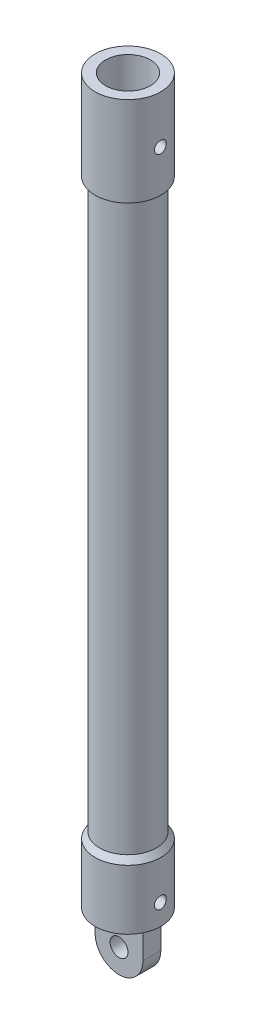
ISO-10303-21;
HEADER;
FILE_DESCRIPTION(('STEP AP214'),'2;1');
FILE_NAME('part.step','',(''),(''),'','','');
FILE_SCHEMA(('AUTOMOTIVE_DESIGN { 1 0 10303 214 1 1 1 1 }'));
ENDSEC;
DATA;
#1=APPLICATION_CONTEXT('core data for automotive mechanical design processes');
#2=APPLICATION_PROTOCOL_DEFINITION('international standard','automotive_design',2000,#1);
#3=PRODUCT_CONTEXT('',#1,'mechanical');
#4=PRODUCT('Part','Part','',(#3));
#5=PRODUCT_RELATED_PRODUCT_CATEGORY('part','',(#4));
#6=PRODUCT_DEFINITION_FORMATION('','',#4);
#7=PRODUCT_DEFINITION_CONTEXT('part definition',#1,'design');
#8=PRODUCT_DEFINITION('design','',#6,#7);
#9=PRODUCT_DEFINITION_SHAPE('','',#8);
#10=(LENGTH_UNIT() NAMED_UNIT(*) SI_UNIT(.MILLI.,.METRE.));
#11=(NAMED_UNIT(*) PLANE_ANGLE_UNIT() SI_UNIT($,.RADIAN.));
#12=(NAMED_UNIT(*) SI_UNIT($,.STERADIAN.) SOLID_ANGLE_UNIT());
#13=UNCERTAINTY_MEASURE_WITH_UNIT(LENGTH_MEASURE(1.E-05),#10,'distance_accuracy_value','');
#14=(GEOMETRIC_REPRESENTATION_CONTEXT(3) GLOBAL_UNCERTAINTY_ASSIGNED_CONTEXT((#13)) GLOBAL_UNIT_ASSIGNED_CONTEXT((#10,
#11,#12)) REPRESENTATION_CONTEXT('',''));
#15=CARTESIAN_POINT('',(0.,0.,0.));
#16=DIRECTION('',(0.,0.,1.));
#17=DIRECTION('',(1.,0.,0.));
#18=AXIS2_PLACEMENT_3D('',#15,#16,#17);
#19=CARTESIAN_POINT('',(0.,121.,0.));
#20=DIRECTION('',(0.,1.,0.));
#21=DIRECTION('',(-1.,0.,0.));
#22=AXIS2_PLACEMENT_3D('',#19,#20,#21);
#23=CYLINDRICAL_SURFACE('',#22,5.49999999999999);
#24=CARTESIAN_POINT('',(0.,9.99999999999999,0.));
#25=DIRECTION('',(0.,1.,0.));
#26=DIRECTION('',(-1.,0.,0.));
#27=AXIS2_PLACEMENT_3D('',#24,#25,#26);
#28=CIRCLE('',#27,5.49999999999998);
#29=CARTESIAN_POINT('',(-5.49999999999998,9.99999999999999,0.));
#30=VERTEX_POINT('',#29);
#31=EDGE_CURVE('E53',#30,#30,#28,.T.);
#32=ORIENTED_EDGE('',*,*,#31,.F.);
#33=EDGE_LOOP('',(#32));
#34=FACE_BOUND('',#33,.T.);
#35=CARTESIAN_POINT('',(0.,0.,0.));
#36=DIRECTION('',(0.,1.,0.));
#37=DIRECTION('',(-1.,0.,0.));
#38=AXIS2_PLACEMENT_3D('',#35,#36,#37);
#39=CIRCLE('',#38,5.5);
#40=CARTESIAN_POINT('',(-5.5,0.,0.));
#41=VERTEX_POINT('',#40);
#42=EDGE_CURVE('E11',#41,#41,#39,.T.);
#43=ORIENTED_EDGE('',*,*,#42,.T.);
#44=EDGE_LOOP('',(#43));
#45=FACE_BOUND('',#44,.T.);
#46=CARTESIAN_POINT('',(5.40832691319598,3.5,0.999999999999986));
#47=CARTESIAN_POINT('',(5.40832797364527,3.55567006127892,0.999997833744751));
#48=CARTESIAN_POINT('',(5.4091957939202,3.61136859562177,0.99533550211966));
#49=CARTESIAN_POINT('',(5.41256931618595,3.72119730791599,0.976820659835397));
#50=CARTESIAN_POINT('',(5.41507644189577,3.77532607983057,0.962960160510861));
#51=CARTESIAN_POINT('',(5.42143545133149,3.88041015651649,0.926486846446951));
#52=CARTESIAN_POINT('',(5.42528611875606,3.93136828265597,0.903881945963418));
#53=CARTESIAN_POINT('',(5.43389689920319,4.02876494581255,0.850582127041999));
#54=CARTESIAN_POINT('',(5.438656932397,4.07520387900767,0.819887918635005));
#55=CARTESIAN_POINT('',(5.44861236895209,4.16279172372141,0.750897624119697));
#56=CARTESIAN_POINT('',(5.45381181531896,4.20388003711712,0.712525176739006));
#57=CARTESIAN_POINT('',(5.46402446588598,4.27907278141708,0.629432698170825));
#58=CARTESIAN_POINT('',(5.46903765818915,4.31317676682265,0.584712262381744));
#59=CARTESIAN_POINT('',(5.47835611996115,4.37366365922516,0.489796709499911));
#60=CARTESIAN_POINT('',(5.48265607320121,4.39998963499791,0.439564745239927));
#61=CARTESIAN_POINT('',(5.49001838668284,4.44380666651306,0.335299887218793));
#62=CARTESIAN_POINT('',(5.49308084259508,4.46129840525468,0.281267287663326));
#63=CARTESIAN_POINT('',(5.49759455294157,4.48676361662773,0.171562418910415));
#64=CARTESIAN_POINT('',(5.4990630727262,4.49483915716037,0.11591456425937));
#65=CARTESIAN_POINT('',(5.50028290444733,4.5015605837312,0.00403573648294886));
#66=CARTESIAN_POINT('',(5.50003435424196,4.50020722678577,-0.0521951894675326));
#67=CARTESIAN_POINT('',(5.49786159276055,4.48818792896104,-0.162944598070384));
#68=CARTESIAN_POINT('',(5.49595715438453,4.47763187324278,-0.217475450026688));
#69=CARTESIAN_POINT('',(5.49070873453987,4.44768040126925,-0.323978745301697));
#70=CARTESIAN_POINT('',(5.4873647029595,4.42828467730689,-0.375951099489815));
#71=CARTESIAN_POINT('',(5.47957960186177,4.38109847011042,-0.476183112726937));
#72=CARTESIAN_POINT('',(5.4751327651169,4.35326367798308,-0.524421446258747));
#73=CARTESIAN_POINT('',(5.4656344841086,4.29002205503766,-0.615583816786477));
#74=CARTESIAN_POINT('',(5.46058298192138,4.25461449853226,-0.658507343849124));
#75=CARTESIAN_POINT('',(5.45034954046419,4.17662577271036,-0.738472225271986));
#76=CARTESIAN_POINT('',(5.44516677076056,4.13394849104051,-0.77541979702476));
#77=CARTESIAN_POINT('',(5.43532481034289,4.04295296803955,-0.841646359820844));
#78=CARTESIAN_POINT('',(5.43066562641451,3.99463465361737,-0.87092525148485));
#79=CARTESIAN_POINT('',(5.42239736704915,3.89360874475659,-0.921007691245477));
#80=CARTESIAN_POINT('',(5.41878990006367,3.84089458418011,-0.941798276926126));
#81=CARTESIAN_POINT('',(5.41305866738467,3.73264127505582,-0.974201884435004));
#82=CARTESIAN_POINT('',(5.41093474435717,3.67710242674443,-0.985815879483392));
#83=CARTESIAN_POINT('',(5.40844202046371,3.5656200993973,-0.999401089257744));
#84=CARTESIAN_POINT('',(5.40804875191387,3.50969353366519,-1.00150674244584));
#85=CARTESIAN_POINT('',(5.40899647576944,3.39828772471947,-0.996375273894262));
#86=CARTESIAN_POINT('',(5.41033738779431,3.34280846089302,-0.989138585178957));
#87=CARTESIAN_POINT('',(5.41457964689336,3.23430982797386,-0.9656430481945));
#88=CARTESIAN_POINT('',(5.41746890003941,3.18127480799599,-0.949454094276894));
#89=CARTESIAN_POINT('',(5.42447195400377,3.07867014058578,-0.908587487859402));
#90=CARTESIAN_POINT('',(5.42858584033863,3.02910073545717,-0.883909242530555));
#91=CARTESIAN_POINT('',(5.43763067076331,2.93424040199238,-0.826452930939983));
#92=CARTESIAN_POINT('',(5.44257002421487,2.88900194095781,-0.793589589707847));
#93=CARTESIAN_POINT('',(5.45268533146009,2.80463315420113,-0.720811524753696));
#94=CARTESIAN_POINT('',(5.457861305175,2.76550334400018,-0.680896206506637));
#95=CARTESIAN_POINT('',(5.46794493022656,2.69396357692511,-0.594548150036321));
#96=CARTESIAN_POINT('',(5.47284841413377,2.6616438223191,-0.548040116261898));
#97=CARTESIAN_POINT('',(5.48176540688882,2.60527684695851,-0.450176309896779));
#98=CARTESIAN_POINT('',(5.48577894853026,2.58122932136142,-0.398820716033939));
#99=CARTESIAN_POINT('',(5.49244586315786,2.54222598068178,-0.292974109172686));
#100=CARTESIAN_POINT('',(5.49510597552398,2.52722504756174,-0.23850016467699));
#101=CARTESIAN_POINT('',(5.49879498739044,2.50659632835142,-0.127753324481755));
#102=CARTESIAN_POINT('',(5.49982404783878,2.50096761743165,-0.0714806068396321));
#103=CARTESIAN_POINT('',(5.50013207106944,2.49927373944725,0.0403998095143955));
#104=CARTESIAN_POINT('',(5.4994360161558,2.50307205575767,0.0960054189627159));
#105=CARTESIAN_POINT('',(5.49642366951048,2.51982647321196,0.205772269495412));
#106=CARTESIAN_POINT('',(5.49410739135889,2.53278249759946,0.259933522681873));
#107=CARTESIAN_POINT('',(5.4881145345394,2.56742845174468,0.365207716720227));
#108=CARTESIAN_POINT('',(5.48444009174283,2.58910467268796,0.416325298323182));
#109=CARTESIAN_POINT('',(5.47612961195726,2.6405597014042,0.514218505970973));
#110=CARTESIAN_POINT('',(5.47149351575704,2.67033900813803,0.560993864398296));
#111=CARTESIAN_POINT('',(5.46169295104725,2.73762881928164,0.649557298768095));
#112=CARTESIAN_POINT('',(5.4565221897774,2.77523834769477,0.691269449293605));
#113=CARTESIAN_POINT('',(5.44627585142042,2.85691475834417,0.767838111774039));
#114=CARTESIAN_POINT('',(5.44120029696122,2.90098315427109,0.80269301217654));
#115=CARTESIAN_POINT('',(5.4316714143499,2.99477983780895,0.864838359022284));
#116=CARTESIAN_POINT('',(5.42722382409738,3.04455361968942,0.892061042527079));
#117=CARTESIAN_POINT('',(5.4195230878375,3.14803163839711,0.937715294552622));
#118=CARTESIAN_POINT('',(5.41626879622785,3.20173204581306,0.956155299818046));
#119=CARTESIAN_POINT('',(5.41201405367095,3.29633834221095,0.979899481024931));
#120=CARTESIAN_POINT('',(5.41063943605989,3.33668463130228,0.987424495948263));
#121=CARTESIAN_POINT('',(5.40879548637076,3.41801547601812,0.997475492125657));
#122=CARTESIAN_POINT('',(5.40832613219443,3.45900001603777,1.00000159540742));
#123=CARTESIAN_POINT('',(5.40832691319598,3.5,0.999999999999986));
#124=B_SPLINE_CURVE_WITH_KNOTS('',3,(#46,#47,#48,#49,#50,#51,#52,#53,#54,#55,#56,#57,#58,#59,
#60,#61,#62,#63,#64,#65,#66,#67,#68,#69,#70,#71,#72,#73,#74,#75,#76,#77,#78,#79,#80,#81,#82,#83,
#84,#85,#86,#87,#88,#89,#90,#91,#92,#93,#94,#95,#96,#97,#98,#99,#100,#101,#102,#103,#104,#105,
#106,#107,#108,#109,#110,#111,#112,#113,#114,#115,#116,#117,#118,#119,#120,#121,#122,#123),
.UNSPECIFIED.,.T.,.F.,(4,2,2,2,2,2,2,2,2,2,2,2,2,2,2,2,2,2,2,2,2,2,2,2,2,2,2,2,2,2,2,2,2,2,2,2,
2,2,4),(0.,0.166860176303694,0.333865461691933,0.500719948670007,0.667559795037679,
0.836149675555551,1.00475030631164,1.17455606253914,1.34434868860495,1.51228319705907,
1.6802042227379,1.84614722644409,2.01209600703444,2.17893164241915,2.34578327259646,
2.51504175421998,2.68430242917503,2.85382062241291,3.02332083504319,3.19041682321415,
3.35750506664222,3.52330682829013,3.68912017065095,3.85673910114988,4.02437216970491,
4.19410261282722,4.36382680048964,4.53269736835609,4.70155127147238,4.86797423941391,
5.03439581247915,5.20055677418129,5.36672796983505,5.53514439851506,5.70360036032117,
5.87350774145283,6.04325157670206,6.16614405072609,6.28903352480283),.UNSPECIFIED.);
#125=CARTESIAN_POINT('',(5.40832691319598,3.5,0.999999999999986));
#126=VERTEX_POINT('',#125);
#127=EDGE_CURVE('E117',#126,#126,#124,.T.);
#128=ORIENTED_EDGE('',*,*,#127,.T.);
#129=EDGE_LOOP('',(#128));
#130=FACE_BOUND('',#129,.T.);
#131=ADVANCED_FACE('F38',(#34,#45,#130),#23,.T.);
#132=CARTESIAN_POINT('',(0.,121.,0.));
#133=DIRECTION('',(0.,1.,0.));
#134=DIRECTION('',(-1.,0.,0.));
#135=AXIS2_PLACEMENT_3D('',#132,#133,#134);
#136=CYLINDRICAL_SURFACE('',#135,5.5);
#137=CARTESIAN_POINT('',(0.,121.,0.));
#138=DIRECTION('',(0.,1.,0.));
#139=DIRECTION('',(-1.,0.,0.));
#140=AXIS2_PLACEMENT_3D('',#137,#138,#139);
#141=CIRCLE('',#140,5.5);
#142=CARTESIAN_POINT('',(-5.5,121.,0.));
#143=VERTEX_POINT('',#142);
#144=EDGE_CURVE('E155',#143,#143,#141,.T.);
#145=ORIENTED_EDGE('',*,*,#144,.F.);
#146=EDGE_LOOP('',(#145));
#147=FACE_BOUND('',#146,.T.);
#148=CARTESIAN_POINT('',(0.,106.,0.));
#149=DIRECTION('',(0.,1.,0.));
#150=DIRECTION('',(-1.,0.,0.));
#151=AXIS2_PLACEMENT_3D('',#148,#149,#150);
#152=CIRCLE('',#151,5.5);
#153=CARTESIAN_POINT('',(-5.5,106.,0.));
#154=VERTEX_POINT('',#153);
#155=EDGE_CURVE('E159',#154,#154,#152,.T.);
#156=ORIENTED_EDGE('',*,*,#155,.T.);
#157=EDGE_LOOP('',(#156));
#158=FACE_BOUND('',#157,.T.);
#159=CARTESIAN_POINT('',(5.40832691319599,113.,0.999999999999999));
#160=CARTESIAN_POINT('',(5.40832797364529,113.055670061279,0.999997833744765));
#161=CARTESIAN_POINT('',(5.40919579392022,113.111368595622,0.995335502119673));
#162=CARTESIAN_POINT('',(5.41256931618597,113.221197307916,0.97682065983541));
#163=CARTESIAN_POINT('',(5.41507644189579,113.275326079831,0.962960160510874));
#164=CARTESIAN_POINT('',(5.42143545133151,113.380410156516,0.926486846446966));
#165=CARTESIAN_POINT('',(5.42528611875607,113.431368282656,0.903881945963434));
#166=CARTESIAN_POINT('',(5.4338968992032,113.528764945813,0.850582127042015));
#167=CARTESIAN_POINT('',(5.43865693239701,113.575203879008,0.819887918635019));
#168=CARTESIAN_POINT('',(5.44861236895211,113.662791723721,0.750897624119713));
#169=CARTESIAN_POINT('',(5.45381181531897,113.703880037117,0.712525176739026));
#170=CARTESIAN_POINT('',(5.464024465886,113.779072781417,0.629432698170844));
#171=CARTESIAN_POINT('',(5.46903765818916,113.813176766823,0.584712262381758));
#172=CARTESIAN_POINT('',(5.47835611996117,113.873663659225,0.489796709499921));
#173=CARTESIAN_POINT('',(5.48265607320123,113.899989634998,0.439564745239938));
#174=CARTESIAN_POINT('',(5.49001838668286,113.943806666513,0.335299887218804));
#175=CARTESIAN_POINT('',(5.49308084259509,113.961298405255,0.281267287663336));
#176=CARTESIAN_POINT('',(5.49759455294158,113.986763616628,0.171562418910424));
#177=CARTESIAN_POINT('',(5.49906307272621,113.99483915716,0.115914564259381));
#178=CARTESIAN_POINT('',(5.50028290444734,114.001560583731,0.00403573648296084));
#179=CARTESIAN_POINT('',(5.50003435424198,114.000207226786,-0.05219518946752));
#180=CARTESIAN_POINT('',(5.49786159276057,113.988187928961,-0.162944598070371));
#181=CARTESIAN_POINT('',(5.49595715438455,113.977631873243,-0.217475450026676));
#182=CARTESIAN_POINT('',(5.49070873453988,113.947680401269,-0.323978745301685));
#183=CARTESIAN_POINT('',(5.48736470295951,113.928284677307,-0.375951099489804));
#184=CARTESIAN_POINT('',(5.47957960186178,113.88109847011,-0.476183112726925));
#185=CARTESIAN_POINT('',(5.47513276511691,113.853263677983,-0.524421446258733));
#186=CARTESIAN_POINT('',(5.46563448410862,113.790022055038,-0.615583816786464));
#187=CARTESIAN_POINT('',(5.4605829819214,113.754614498532,-0.658507343849112));
#188=CARTESIAN_POINT('',(5.45034954046421,113.67662577271,-0.738472225271975));
#189=CARTESIAN_POINT('',(5.44516677076058,113.63394849104,-0.775419797024749));
#190=CARTESIAN_POINT('',(5.43532481034291,113.54295296804,-0.841646359820832));
#191=CARTESIAN_POINT('',(5.43066562641453,113.494634653617,-0.870925251484838));
#192=CARTESIAN_POINT('',(5.42239736704917,113.393608744757,-0.921007691245465));
#193=CARTESIAN_POINT('',(5.41878990006369,113.34089458418,-0.941798276926114));
#194=CARTESIAN_POINT('',(5.41305866738469,113.232641275056,-0.974201884434991));
#195=CARTESIAN_POINT('',(5.41093474435719,113.177102426744,-0.985815879483378));
#196=CARTESIAN_POINT('',(5.40844202046373,113.065620099397,-0.999401089257731));
#197=CARTESIAN_POINT('',(5.40804875191389,113.009693533665,-1.00150674244582));
#198=CARTESIAN_POINT('',(5.40899647576946,112.898287724719,-0.996375273894249));
#199=CARTESIAN_POINT('',(5.41033738779433,112.842808460893,-0.989138585178944));
#200=CARTESIAN_POINT('',(5.41457964689338,112.734309827974,-0.965643048194487));
#201=CARTESIAN_POINT('',(5.41746890003943,112.681274807996,-0.949454094276882));
#202=CARTESIAN_POINT('',(5.42447195400378,112.578670140586,-0.908587487859393));
#203=CARTESIAN_POINT('',(5.42858584033865,112.529100735457,-0.883909242530546));
#204=CARTESIAN_POINT('',(5.43763067076332,112.434240401992,-0.826452930939976));
#205=CARTESIAN_POINT('',(5.44257002421489,112.389001940958,-0.793589589707839));
#206=CARTESIAN_POINT('',(5.45268533146011,112.304633154201,-0.720811524753687));
#207=CARTESIAN_POINT('',(5.45786130517502,112.265503344,-0.68089620650663));
#208=CARTESIAN_POINT('',(5.46794493022658,112.193963576925,-0.594548150036311));
#209=CARTESIAN_POINT('',(5.47284841413379,112.161643822319,-0.548040116261884));
#210=CARTESIAN_POINT('',(5.48176540688884,112.105276846958,-0.450176309896763));
#211=CARTESIAN_POINT('',(5.48577894853028,112.081229321361,-0.398820716033923));
#212=CARTESIAN_POINT('',(5.49244586315788,112.042225980682,-0.292974109172672));
#213=CARTESIAN_POINT('',(5.49510597552399,112.027225047562,-0.238500164676975));
#214=CARTESIAN_POINT('',(5.49879498739045,112.006596328351,-0.127753324481742));
#215=CARTESIAN_POINT('',(5.49982404783879,112.000967617432,-0.0714806068396194));
#216=CARTESIAN_POINT('',(5.50013207106945,111.999273739447,0.0403998095144082));
#217=CARTESIAN_POINT('',(5.49943601615581,112.003072055758,0.0960054189627291));
#218=CARTESIAN_POINT('',(5.4964236695105,112.019826473212,0.205772269495425));
#219=CARTESIAN_POINT('',(5.49410739135891,112.032782497599,0.259933522681887));
#220=CARTESIAN_POINT('',(5.48811453453941,112.067428451745,0.365207716720242));
#221=CARTESIAN_POINT('',(5.48444009174285,112.089104672688,0.416325298323198));
#222=CARTESIAN_POINT('',(5.47612961195727,112.140559701404,0.51421850597099));
#223=CARTESIAN_POINT('',(5.47149351575706,112.170339008138,0.560993864398314));
#224=CARTESIAN_POINT('',(5.46169295104727,112.237628819282,0.649557298768114));
#225=CARTESIAN_POINT('',(5.45652218977741,112.275238347695,0.691269449293626));
#226=CARTESIAN_POINT('',(5.44627585142044,112.356914758344,0.76783811177406));
#227=CARTESIAN_POINT('',(5.44120029696123,112.400983154271,0.802693012176559));
#228=CARTESIAN_POINT('',(5.43167141434991,112.494779837809,0.864838359022302));
#229=CARTESIAN_POINT('',(5.42722382409739,112.544553619689,0.892061042527098));
#230=CARTESIAN_POINT('',(5.41952308783752,112.648031638397,0.937715294552638));
#231=CARTESIAN_POINT('',(5.41626879622787,112.701732045813,0.956155299818059));
#232=CARTESIAN_POINT('',(5.41201405367096,112.796338342211,0.979899481024943));
#233=CARTESIAN_POINT('',(5.41063943605991,112.836684631302,0.987424495948276));
#234=CARTESIAN_POINT('',(5.40879548637077,112.918015476018,0.997475492125671));
#235=CARTESIAN_POINT('',(5.40832613219444,112.959000016038,1.00000159540744));
#236=CARTESIAN_POINT('',(5.40832691319599,113.,0.999999999999999));
#237=B_SPLINE_CURVE_WITH_KNOTS('',3,(#159,#160,#161,#162,#163,#164,#165,#166,#167,#168,#169,
#170,#171,#172,#173,#174,#175,#176,#177,#178,#179,#180,#181,#182,#183,#184,#185,#186,#187,#188,
#189,#190,#191,#192,#193,#194,#195,#196,#197,#198,#199,#200,#201,#202,#203,#204,#205,#206,#207,
#208,#209,#210,#211,#212,#213,#214,#215,#216,#217,#218,#219,#220,#221,#222,#223,#224,#225,#226,
#227,#228,#229,#230,#231,#232,#233,#234,#235,#236),.UNSPECIFIED.,.T.,.F.,(4,2,2,2,2,2,2,2,2,2,2,
2,2,2,2,2,2,2,2,2,2,2,2,2,2,2,2,2,2,2,2,2,2,2,2,2,2,2,4),(0.,0.166860176303694,
0.333865461691934,0.500719948670008,0.667559795037674,0.836149675555549,1.00475030631164,
1.17455606253914,1.34434868860496,1.51228319705907,1.6802042227379,1.84614722644409,
2.01209600703445,2.17893164241915,2.34578327259646,2.51504175421998,2.68430242917503,
2.85382062241292,3.02332083504319,3.19041682321415,3.35750506664222,3.52330682829013,
3.68912017065093,3.85673910114987,4.02437216970491,4.19410261282723,4.36382680048964,
4.53269736835609,4.70155127147238,4.86797423941392,5.03439581247915,5.20055677418129,
5.36672796983505,5.53514439851507,5.70360036032118,5.87350774145284,6.04325157670205,
6.16614405072609,6.28903352480284),.UNSPECIFIED.);
#238=CARTESIAN_POINT('',(5.40832691319599,113.,0.999999999999999));
#239=VERTEX_POINT('',#238);
#240=EDGE_CURVE('E180',#239,#239,#237,.T.);
#241=ORIENTED_EDGE('',*,*,#240,.T.);
#242=EDGE_LOOP('',(#241));
#243=FACE_BOUND('',#242,.T.);
#244=ADVANCED_FACE('F204',(#147,#158,#243),#136,.T.);
#245=CARTESIAN_POINT('',(0.,121.,0.));
#246=DIRECTION('',(0.,1.,0.));
#247=DIRECTION('',(-1.,0.,0.));
#248=AXIS2_PLACEMENT_3D('',#245,#246,#247);
#249=CYLINDRICAL_SURFACE('',#248,3.74999999999997);
#250=CARTESIAN_POINT('',(3.61420807370022,113.,0.999999999999999));
#251=CARTESIAN_POINT('',(3.6142090287188,112.944912031145,0.999998671581129));
#252=CARTESIAN_POINT('',(3.61548132371101,112.889809999806,0.995432466133931));
#253=CARTESIAN_POINT('',(3.62041780675328,112.781197289262,0.977322916311277));
#254=CARTESIAN_POINT('',(3.62408319480182,112.727687422519,0.963775068106201));
#255=CARTESIAN_POINT('',(3.63336187562292,112.623845965012,0.9281792277968));
#256=CARTESIAN_POINT('',(3.63897242835094,112.573510020582,0.906143187709931));
#257=CARTESIAN_POINT('',(3.65150577467204,112.477241629974,0.854233922819474));
#258=CARTESIAN_POINT('',(3.65842867019106,112.431309526248,0.824360089207507));
#259=CARTESIAN_POINT('',(3.67300069774791,112.344003726505,0.756824239372529));
#260=CARTESIAN_POINT('',(3.68066270557699,112.302756491267,0.719001487520965));
#261=CARTESIAN_POINT('',(3.69573850718771,112.227109211525,0.636987136420171));
#262=CARTESIAN_POINT('',(3.70315227516857,112.192709876929,0.592794877673342));
#263=CARTESIAN_POINT('',(3.71703994234064,112.131207530798,0.49841908543662));
#264=CARTESIAN_POINT('',(3.72349688131106,112.104230240684,0.448150909939738));
#265=CARTESIAN_POINT('',(3.73459563105953,112.059157682316,0.343591522364551));
#266=CARTESIAN_POINT('',(3.73923774788139,112.041060916359,0.289300990437553));
#267=CARTESIAN_POINT('',(3.74609276788218,112.014672389882,0.179557980905042));
#268=CARTESIAN_POINT('',(3.74835888375127,112.006165511687,0.124160612100455));
#269=CARTESIAN_POINT('',(3.75039262308875,111.998521439946,0.0126817767542861));
#270=CARTESIAN_POINT('',(3.75016066473302,111.999382678185,-0.0433995737192661));
#271=CARTESIAN_POINT('',(3.7472633792988,112.01029890627,-0.153157118555675));
#272=CARTESIAN_POINT('',(3.74465957013498,112.020121478818,-0.206858300360559));
#273=CARTESIAN_POINT('',(3.73738374295231,112.048306068891,-0.311820657785531));
#274=CARTESIAN_POINT('',(3.73271160700287,112.066668573343,-0.363081694090293));
#275=CARTESIAN_POINT('',(3.72173284549949,112.111589923796,-0.462301972573779));
#276=CARTESIAN_POINT('',(3.71541043938854,112.13822840355,-0.510223343164773));
#277=CARTESIAN_POINT('',(3.70181234254728,112.198884409755,-0.600994999382261));
#278=CARTESIAN_POINT('',(3.69453646611419,112.232903374514,-0.643844294042933));
#279=CARTESIAN_POINT('',(3.67955636469437,112.308588428967,-0.724642684732808));
#280=CARTESIAN_POINT('',(3.67184584684671,112.350457222525,-0.762400960088875));
#281=CARTESIAN_POINT('',(3.65706702511453,112.440012338119,-0.830406660523847));
#282=CARTESIAN_POINT('',(3.64999876040392,112.4876990146,-0.860653627649027));
#283=CARTESIAN_POINT('',(3.63727951141531,112.587950050911,-0.91292339593139));
#284=CARTESIAN_POINT('',(3.63163753550362,112.640542675457,-0.934894333002691));
#285=CARTESIAN_POINT('',(3.6225216253947,112.748863249727,-0.969620008428325));
#286=CARTESIAN_POINT('',(3.61904715357425,112.804590418224,-0.982377032306516));
#287=CARTESIAN_POINT('',(3.61477417822019,112.915813605511,-0.997983785463862));
#288=CARTESIAN_POINT('',(3.61389881663846,112.971266774305,-1.00111816310609));
#289=CARTESIAN_POINT('',(3.61471289252318,113.081904886401,-0.998174905615003));
#290=CARTESIAN_POINT('',(3.61640205703345,113.137089857621,-0.992098250861083));
#291=CARTESIAN_POINT('',(3.62208062144614,113.244528297049,-0.971156359349568));
#292=CARTESIAN_POINT('',(3.62602519845674,113.296817718969,-0.956462239564532));
#293=CARTESIAN_POINT('',(3.63572634480363,113.398189815679,-0.918894933627447));
#294=CARTESIAN_POINT('',(3.64148315075355,113.447272070713,-0.896020679383275));
#295=CARTESIAN_POINT('',(3.6543178623539,113.542027478718,-0.842164527543513));
#296=CARTESIAN_POINT('',(3.66142202436135,113.587601987945,-0.811015476189618));
#297=CARTESIAN_POINT('',(3.67608920967126,113.672981650851,-0.741701139937582));
#298=CARTESIAN_POINT('',(3.68365231905197,113.712785717477,-0.703534536114836));
#299=CARTESIAN_POINT('',(3.69864982442143,113.786676236625,-0.619951891252417));
#300=CARTESIAN_POINT('',(3.706074182619,113.820564188489,-0.574358208004418));
#301=CARTESIAN_POINT('',(3.71973335008583,113.880205493705,-0.477964217970366));
#302=CARTESIAN_POINT('',(3.72596822266455,113.905959280039,-0.427164188509439));
#303=CARTESIAN_POINT('',(3.73650575449622,113.948364816181,-0.322157067412936));
#304=CARTESIAN_POINT('',(3.7408227924019,113.965084509722,-0.267978926441167));
#305=CARTESIAN_POINT('',(3.74710151893621,113.989144364032,-0.157449692365659));
#306=CARTESIAN_POINT('',(3.74906372952483,113.996486603387,-0.101099083660122));
#307=CARTESIAN_POINT('',(3.75038706718848,114.001452911871,0.0103210006730798));
#308=CARTESIAN_POINT('',(3.74982613144057,113.999368159566,0.0653767557639443));
#309=CARTESIAN_POINT('',(3.7463424548941,113.986215753212,0.174324152315348));
#310=CARTESIAN_POINT('',(3.74341980277323,113.975148436442,0.228215837406365));
#311=CARTESIAN_POINT('',(3.73555655195526,113.944509697541,0.332955061732147));
#312=CARTESIAN_POINT('',(3.7306299859486,113.924997353264,0.383821005925924));
#313=CARTESIAN_POINT('',(3.71927408257997,113.878075199127,0.481586049235517));
#314=CARTESIAN_POINT('',(3.71284453448701,113.850664281694,0.528484590830488));
#315=CARTESIAN_POINT('',(3.69895665613007,113.787870863931,0.618339134337436));
#316=CARTESIAN_POINT('',(3.69147546689398,113.752295309647,0.661156680868925));
#317=CARTESIAN_POINT('',(3.67642000035042,113.674548625321,0.740312685778395));
#318=CARTESIAN_POINT('',(3.6688456990647,113.632375762103,0.776649436206762));
#319=CARTESIAN_POINT('',(3.65426979833132,113.54151580208,0.842603501170396));
#320=CARTESIAN_POINT('',(3.64728445663955,113.492705843126,0.872055471336938));
#321=CARTESIAN_POINT('',(3.63490697001712,113.390646844523,0.922293445181003));
#322=CARTESIAN_POINT('',(3.62951378372913,113.337400735717,0.943085116844286));
#323=CARTESIAN_POINT('',(3.62168000318186,113.236959331983,0.972690621256594));
#324=CARTESIAN_POINT('',(3.61890070138956,113.190199367726,0.982907591996378));
#325=CARTESIAN_POINT('',(3.61516442602922,113.095629720999,0.996562471470464));
#326=CARTESIAN_POINT('',(3.61420724467818,113.047820158848,1.00000115315926));
#327=CARTESIAN_POINT('',(3.61420807370022,113.,0.999999999999999));
#328=B_SPLINE_CURVE_WITH_KNOTS('',3,(#250,#251,#252,#253,#254,#255,#256,#257,#258,#259,#260,
#261,#262,#263,#264,#265,#266,#267,#268,#269,#270,#271,#272,#273,#274,#275,#276,#277,#278,#279,
#280,#281,#282,#283,#284,#285,#286,#287,#288,#289,#290,#291,#292,#293,#294,#295,#296,#297,#298,
#299,#300,#301,#302,#303,#304,#305,#306,#307,#308,#309,#310,#311,#312,#313,#314,#315,#316,#317,
#318,#319,#320,#321,#322,#323,#324,#325,#326,#327),.UNSPECIFIED.,.T.,.F.,(4,2,2,2,2,2,2,2,2,2,2,
2,2,2,2,2,2,2,2,2,2,2,2,2,2,2,2,2,2,2,2,2,2,2,2,2,2,2,4),(0.,0.165088064036904,
0.330258973884209,0.495198155757184,0.660150153239633,0.828829580610165,0.997526485581404,
1.16892603681312,1.34029667148034,1.50774152154151,1.67515834188712,1.83835285396313,
2.00155667216259,2.16638224448696,2.33123996693156,2.50115881146076,2.67108801315701,
2.84206507544181,3.01299971205166,3.1788266711562,3.34463598165073,3.50725925209608,
3.66990376425733,3.83612317477206,4.00237385764057,4.17342953473138,4.34447610497372,
4.51421769789021,4.68392165972823,4.84842027451552,5.01291271299801,5.17627257427653,
5.33965535376302,5.50739426989109,5.67517732683844,5.84665019485554,6.01801066042692,
6.16133483827803,6.30464267137362),.UNSPECIFIED.);
#329=CARTESIAN_POINT('',(3.61420807370022,113.,0.999999999999999));
#330=VERTEX_POINT('',#329);
#331=EDGE_CURVE('E173',#330,#330,#328,.T.);
#332=ORIENTED_EDGE('',*,*,#331,.T.);
#333=EDGE_LOOP('',(#332));
#334=FACE_BOUND('',#333,.T.);
#335=CARTESIAN_POINT('',(0.,121.,0.));
#336=DIRECTION('',(0.,1.,0.));
#337=DIRECTION('',(-1.,0.,0.));
#338=AXIS2_PLACEMENT_3D('',#335,#336,#337);
#339=CIRCLE('',#338,3.74999999999998);
#340=CARTESIAN_POINT('',(-3.74999999999998,121.,0.));
#341=VERTEX_POINT('',#340);
#342=EDGE_CURVE('E151',#341,#341,#339,.T.);
#343=ORIENTED_EDGE('',*,*,#342,.T.);
#344=EDGE_LOOP('',(#343));
#345=FACE_BOUND('',#344,.T.);
#346=CARTESIAN_POINT('',(0.,2.,0.));
#347=DIRECTION('',(0.,1.,0.));
#348=DIRECTION('',(-1.,0.,0.));
#349=AXIS2_PLACEMENT_3D('',#346,#347,#348);
#350=CIRCLE('',#349,3.74999999999996);
#351=CARTESIAN_POINT('',(-3.74999999999996,2.,0.));
#352=VERTEX_POINT('',#351);
#353=EDGE_CURVE('E142',#352,#352,#350,.T.);
#354=ORIENTED_EDGE('',*,*,#353,.F.);
#355=EDGE_LOOP('',(#354));
#356=FACE_BOUND('',#355,.T.);
#357=CARTESIAN_POINT('',(3.61420807370022,3.5,0.999999999999986));
#358=CARTESIAN_POINT('',(3.6142090287188,3.4449120311451,0.999998671581116));
#359=CARTESIAN_POINT('',(3.61548132371101,3.38980999980598,0.995432466133918));
#360=CARTESIAN_POINT('',(3.62041780675328,3.28119728926221,0.977322916311264));
#361=CARTESIAN_POINT('',(3.62408319480182,3.227687422519,0.963775068106187));
#362=CARTESIAN_POINT('',(3.63336187562292,3.12384596501239,0.928179227796786));
#363=CARTESIAN_POINT('',(3.63897242835094,3.07351002058197,0.906143187709917));
#364=CARTESIAN_POINT('',(3.65150577467204,2.97724162997391,0.85423392281946));
#365=CARTESIAN_POINT('',(3.65842867019106,2.93130952624754,0.824360089207492));
#366=CARTESIAN_POINT('',(3.67300069774791,2.84400372650509,0.756824239372518));
#367=CARTESIAN_POINT('',(3.68066270557699,2.80275649126749,0.719001487520956));
#368=CARTESIAN_POINT('',(3.69573850718771,2.72710921152469,0.63698713642016));
#369=CARTESIAN_POINT('',(3.70315227516857,2.69270987692918,0.592794877673326));
#370=CARTESIAN_POINT('',(3.71703994234064,2.63120753079846,0.4984190854366));
#371=CARTESIAN_POINT('',(3.72349688131106,2.60423024068355,0.44815090993972));
#372=CARTESIAN_POINT('',(3.73459563105952,2.5591576823164,0.343591522364535));
#373=CARTESIAN_POINT('',(3.73923774788138,2.54106091635923,0.289300990437538));
#374=CARTESIAN_POINT('',(3.74609276788218,2.51467238988211,0.179557980905029));
#375=CARTESIAN_POINT('',(3.74835888375127,2.50616551168704,0.124160612100443));
#376=CARTESIAN_POINT('',(3.75039262308874,2.49852143994642,0.0126817767542734));
#377=CARTESIAN_POINT('',(3.75016066473302,2.49938267818493,-0.0433995737192794));
#378=CARTESIAN_POINT('',(3.74726337929879,2.51029890626974,-0.153157118555688));
#379=CARTESIAN_POINT('',(3.74465957013498,2.52012147881815,-0.20685830036057));
#380=CARTESIAN_POINT('',(3.73738374295231,2.54830606889098,-0.311820657785542));
#381=CARTESIAN_POINT('',(3.73271160700286,2.56666857334303,-0.363081694090304));
#382=CARTESIAN_POINT('',(3.72173284549948,2.61158992379619,-0.462301972573791));
#383=CARTESIAN_POINT('',(3.71541043938854,2.63822840355035,-0.510223343164784));
#384=CARTESIAN_POINT('',(3.70181234254728,2.69888440975455,-0.600994999382271));
#385=CARTESIAN_POINT('',(3.69453646611419,2.73290337451409,-0.643844294042943));
#386=CARTESIAN_POINT('',(3.67955636469437,2.80858842896696,-0.724642684732819));
#387=CARTESIAN_POINT('',(3.67184584684671,2.8504572225247,-0.762400960088886));
#388=CARTESIAN_POINT('',(3.65706702511452,2.94001233811939,-0.830406660523859));
#389=CARTESIAN_POINT('',(3.64999876040391,2.98769901460016,-0.860653627649039));
#390=CARTESIAN_POINT('',(3.6372795114153,3.08795005091073,-0.912923395931398));
#391=CARTESIAN_POINT('',(3.63163753550361,3.14054267545684,-0.934894333002696));
#392=CARTESIAN_POINT('',(3.62252162539469,3.24886324972723,-0.969620008428332));
#393=CARTESIAN_POINT('',(3.61904715357425,3.30459041822421,-0.982377032306526));
#394=CARTESIAN_POINT('',(3.61477417822018,3.41581360551081,-0.997983785463876));
#395=CARTESIAN_POINT('',(3.61389881663845,3.47126677430537,-1.0011181631061));
#396=CARTESIAN_POINT('',(3.61471289252317,3.58190488640124,-0.998174905615015));
#397=CARTESIAN_POINT('',(3.61640205703344,3.63708985762111,-0.992098250861096));
#398=CARTESIAN_POINT('',(3.62208062144613,3.7445282970488,-0.971156359349583));
#399=CARTESIAN_POINT('',(3.62602519845673,3.79681771896943,-0.956462239564548));
#400=CARTESIAN_POINT('',(3.63572634480362,3.89818981567916,-0.918894933627462));
#401=CARTESIAN_POINT('',(3.64148315075354,3.9472720707135,-0.89602067938329));
#402=CARTESIAN_POINT('',(3.6543178623539,4.04202747871783,-0.842164527543527));
#403=CARTESIAN_POINT('',(3.66142202436134,4.08760198794493,-0.811015476189631));
#404=CARTESIAN_POINT('',(3.67608920967125,4.17298165085152,-0.741701139937595));
#405=CARTESIAN_POINT('',(3.68365231905196,4.21278571747706,-0.703534536114849));
#406=CARTESIAN_POINT('',(3.69864982442142,4.28667623662498,-0.619951891252434));
#407=CARTESIAN_POINT('',(3.70607418261899,4.3205641884893,-0.574358208004438));
#408=CARTESIAN_POINT('',(3.71973335008583,4.38020549370526,-0.477964217970387));
#409=CARTESIAN_POINT('',(3.72596822266455,4.40595928003946,-0.427164188509457));
#410=CARTESIAN_POINT('',(3.73650575449622,4.44836481618076,-0.32215706741295));
#411=CARTESIAN_POINT('',(3.74082279240189,4.46508450972174,-0.267978926441182));
#412=CARTESIAN_POINT('',(3.74710151893621,4.48914436403218,-0.157449692365675));
#413=CARTESIAN_POINT('',(3.74906372952482,4.49648660338735,-0.10109908366014));
#414=CARTESIAN_POINT('',(3.75038706718847,4.50145291187072,0.0103210006730629));
#415=CARTESIAN_POINT('',(3.74982613144056,4.49936815956557,0.0653767557639285));
#416=CARTESIAN_POINT('',(3.74634245489409,4.48621575321242,0.174324152315333));
#417=CARTESIAN_POINT('',(3.74341980277323,4.47514843644154,0.22821583740635));
#418=CARTESIAN_POINT('',(3.73555655195525,4.44450969754064,0.332955061732132));
#419=CARTESIAN_POINT('',(3.73062998594859,4.42499735326355,0.383821005925912));
#420=CARTESIAN_POINT('',(3.71927408257997,4.37807519912712,0.481586049235505));
#421=CARTESIAN_POINT('',(3.712844534487,4.35066428169447,0.528484590830475));
#422=CARTESIAN_POINT('',(3.69895665613006,4.28787086393059,0.618339134337421));
#423=CARTESIAN_POINT('',(3.69147546689398,4.25229530964728,0.661156680868911));
#424=CARTESIAN_POINT('',(3.67642000035042,4.17454862532095,0.740312685778379));
#425=CARTESIAN_POINT('',(3.6688456990647,4.13237576210302,0.776649436206746));
#426=CARTESIAN_POINT('',(3.65426979833132,4.04151580207972,0.842603501170378));
#427=CARTESIAN_POINT('',(3.64728445663955,3.99270584312566,0.872055471336918));
#428=CARTESIAN_POINT('',(3.63490697001712,3.89064684452328,0.922293445180986));
#429=CARTESIAN_POINT('',(3.62951378372913,3.83740073571704,0.943085116844272));
#430=CARTESIAN_POINT('',(3.62168000318185,3.7369593319835,0.972690621256583));
#431=CARTESIAN_POINT('',(3.61890070138956,3.69019936772571,0.982907591996365));
#432=CARTESIAN_POINT('',(3.61516442602922,3.59562972099896,0.99656247147045));
#433=CARTESIAN_POINT('',(3.61420724467818,3.54782015884848,1.00000115315925));
#434=CARTESIAN_POINT('',(3.61420807370022,3.5,0.999999999999986));
#435=B_SPLINE_CURVE_WITH_KNOTS('',3,(#357,#358,#359,#360,#361,#362,#363,#364,#365,#366,#367,
#368,#369,#370,#371,#372,#373,#374,#375,#376,#377,#378,#379,#380,#381,#382,#383,#384,#385,#386,
#387,#388,#389,#390,#391,#392,#393,#394,#395,#396,#397,#398,#399,#400,#401,#402,#403,#404,#405,
#406,#407,#408,#409,#410,#411,#412,#413,#414,#415,#416,#417,#418,#419,#420,#421,#422,#423,#424,
#425,#426,#427,#428,#429,#430,#431,#432,#433,#434),.UNSPECIFIED.,.T.,.F.,(4,2,2,2,2,2,2,2,2,2,2,
2,2,2,2,2,2,2,2,2,2,2,2,2,2,2,2,2,2,2,2,2,2,2,2,2,2,2,4),(0.,0.165088064036903,
0.330258973884208,0.495198155757191,0.660150153239631,0.828829580610162,0.997526485581413,
1.16892603681312,1.34029667148034,1.50774152154151,1.67515834188712,1.83835285396312,
2.00155667216258,2.16638224448696,2.33123996693156,2.50115881146075,2.671088013157,
2.84206507544179,3.01299971205164,3.17882667115621,3.34463598165072,3.50725925209608,
3.66990376425732,3.83612317477206,4.00237385764058,4.17342953473137,4.34447610497372,
4.51421769789021,4.68392165972823,4.84842027451552,5.01291271299802,5.17627257427653,
5.33965535376302,5.50739426989109,5.67517732683844,5.84665019485553,6.01801066042692,
6.16133483827804,6.30464267137362),.UNSPECIFIED.);
#436=CARTESIAN_POINT('',(3.61420807370022,3.5,0.999999999999986));
#437=VERTEX_POINT('',#436);
#438=EDGE_CURVE('E42',#437,#437,#435,.T.);
#439=ORIENTED_EDGE('',*,*,#438,.T.);
#440=EDGE_LOOP('',(#439));
#441=FACE_BOUND('',#440,.T.);
#442=ADVANCED_FACE('F181',(#334,#345,#356,#441),#249,.F.);
#443=CARTESIAN_POINT('',(0.,0.,0.));
#444=DIRECTION('',(0.,-1.,0.));
#445=DIRECTION('',(1.,0.,0.));
#446=AXIS2_PLACEMENT_3D('',#443,#444,#445);
#447=PLANE('',#446);
#448=ORIENTED_EDGE('',*,*,#42,.F.);
#449=EDGE_LOOP('',(#448));
#450=FACE_BOUND('',#449,.T.);
#451=DIRECTION('',(-1.,0.,0.));
#452=VECTOR('',#451,1.);
#453=CARTESIAN_POINT('',(-4.,0.,-1.5));
#454=LINE('',#453,#452);
#455=CARTESIAN_POINT('',(4.,0.,-1.5));
#456=VERTEX_POINT('',#455);
#457=CARTESIAN_POINT('',(-4.,0.,-1.5));
#458=VERTEX_POINT('',#457);
#459=EDGE_CURVE('E97',#456,#458,#454,.T.);
#460=ORIENTED_EDGE('',*,*,#459,.T.);
#461=DIRECTION('',(0.,0.,1.));
#462=VECTOR('',#461,1.);
#463=CARTESIAN_POINT('',(-4.,0.,-1.5));
#464=LINE('',#463,#462);
#465=CARTESIAN_POINT('',(-4.,0.,1.5));
#466=VERTEX_POINT('',#465);
#467=EDGE_CURVE('E139',#458,#466,#464,.T.);
#468=ORIENTED_EDGE('',*,*,#467,.T.);
#469=DIRECTION('',(-1.,0.,0.));
#470=VECTOR('',#469,1.);
#471=CARTESIAN_POINT('',(-4.,0.,1.5));
#472=LINE('',#471,#470);
#473=CARTESIAN_POINT('',(4.,0.,1.5));
#474=VERTEX_POINT('',#473);
#475=EDGE_CURVE('E111',#474,#466,#472,.T.);
#476=ORIENTED_EDGE('',*,*,#475,.F.);
#477=DIRECTION('',(0.,0.,1.));
#478=VECTOR('',#477,1.);
#479=CARTESIAN_POINT('',(4.,0.,-1.5));
#480=LINE('',#479,#478);
#481=EDGE_CURVE('E143',#456,#474,#480,.T.);
#482=ORIENTED_EDGE('',*,*,#481,.F.);
#483=EDGE_LOOP('',(#460,#468,#476,#482));
#484=FACE_BOUND('',#483,.T.);
#485=ADVANCED_FACE('F40',(#450,#484),#447,.T.);
#486=CARTESIAN_POINT('',(0.,11.,0.));
#487=DIRECTION('',(0.,-1.,0.));
#488=DIRECTION('',(1.,0.,0.));
#489=AXIS2_PLACEMENT_3D('',#486,#487,#488);
#490=CONICAL_SURFACE('',#489,4.74999999999998,0.643501108793283);
#491=ORIENTED_EDGE('',*,*,#31,.T.);
#492=EDGE_LOOP('',(#491));
#493=FACE_BOUND('',#492,.T.);
#494=CARTESIAN_POINT('',(0.,11.,0.));
#495=DIRECTION('',(0.,1.,0.));
#496=DIRECTION('',(-1.,0.,0.));
#497=AXIS2_PLACEMENT_3D('',#494,#495,#496);
#498=CIRCLE('',#497,4.74999999999998);
#499=CARTESIAN_POINT('',(-4.74999999999998,11.,0.));
#500=VERTEX_POINT('',#499);
#501=EDGE_CURVE('E167',#500,#500,#498,.T.);
#502=ORIENTED_EDGE('',*,*,#501,.F.);
#503=EDGE_LOOP('',(#502));
#504=FACE_BOUND('',#503,.T.);
#505=ADVANCED_FACE('F217',(#493,#504),#490,.T.);
#506=CARTESIAN_POINT('',(0.,121.,0.));
#507=DIRECTION('',(0.,1.,0.));
#508=DIRECTION('',(-1.,0.,0.));
#509=AXIS2_PLACEMENT_3D('',#506,#507,#508);
#510=CYLINDRICAL_SURFACE('',#509,4.74999999999998);
#511=ORIENTED_EDGE('',*,*,#501,.T.);
#512=EDGE_LOOP('',(#511));
#513=FACE_BOUND('',#512,.T.);
#514=CARTESIAN_POINT('',(0.,106.,0.));
#515=DIRECTION('',(0.,1.,0.));
#516=DIRECTION('',(-1.,0.,0.));
#517=AXIS2_PLACEMENT_3D('',#514,#515,#516);
#518=CIRCLE('',#517,4.74999999999998);
#519=CARTESIAN_POINT('',(-4.74999999999998,106.,0.));
#520=VERTEX_POINT('',#519);
#521=EDGE_CURVE('E163',#520,#520,#518,.T.);
#522=ORIENTED_EDGE('',*,*,#521,.F.);
#523=EDGE_LOOP('',(#522));
#524=FACE_BOUND('',#523,.T.);
#525=ADVANCED_FACE('F213',(#513,#524),#510,.T.);
#526=CARTESIAN_POINT('',(-4.74999999999998,106.,0.));
#527=DIRECTION('',(0.,-1.,0.));
#528=DIRECTION('',(1.,0.,0.));
#529=AXIS2_PLACEMENT_3D('',#526,#527,#528);
#530=PLANE('',#529);
#531=ORIENTED_EDGE('',*,*,#521,.T.);
#532=EDGE_LOOP('',(#531));
#533=FACE_BOUND('',#532,.T.);
#534=ORIENTED_EDGE('',*,*,#155,.F.);
#535=EDGE_LOOP('',(#534));
#536=FACE_BOUND('',#535,.T.);
#537=ADVANCED_FACE('F210',(#533,#536),#530,.T.);
#538=CARTESIAN_POINT('',(-5.5,121.,0.));
#539=DIRECTION('',(0.,1.,0.));
#540=DIRECTION('',(-1.,0.,0.));
#541=AXIS2_PLACEMENT_3D('',#538,#539,#540);
#542=PLANE('',#541);
#543=ORIENTED_EDGE('',*,*,#144,.T.);
#544=EDGE_LOOP('',(#543));
#545=FACE_BOUND('',#544,.T.);
#546=ORIENTED_EDGE('',*,*,#342,.F.);
#547=EDGE_LOOP('',(#546));
#548=FACE_BOUND('',#547,.T.);
#549=ADVANCED_FACE('F209',(#545,#548),#542,.T.);
#550=CARTESIAN_POINT('',(-3.74999999999996,2.,0.));
#551=DIRECTION('',(0.,1.,0.));
#552=DIRECTION('',(-1.,0.,0.));
#553=AXIS2_PLACEMENT_3D('',#550,#551,#552);
#554=PLANE('',#553);
#555=ORIENTED_EDGE('',*,*,#353,.T.);
#556=EDGE_LOOP('',(#555));
#557=FACE_BOUND('',#556,.T.);
#558=ADVANCED_FACE('F286',(#557),#554,.T.);
#559=CARTESIAN_POINT('',(-4.,0.,-1.5));
#560=DIRECTION('',(-1.,0.,0.));
#561=DIRECTION('',(0.,-1.,0.));
#562=AXIS2_PLACEMENT_3D('',#559,#560,#561);
#563=PLANE('',#562);
#564=DIRECTION('',(0.,0.,1.));
#565=VECTOR('',#564,1.);
#566=CARTESIAN_POINT('',(-4.,-5.,-1.5));
#567=LINE('',#566,#565);
#568=CARTESIAN_POINT('',(-4.,-5.,-1.5));
#569=VERTEX_POINT('',#568);
#570=CARTESIAN_POINT('',(-4.,-5.,1.5));
#571=VERTEX_POINT('',#570);
#572=EDGE_CURVE('E87',#569,#571,#567,.T.);
#573=ORIENTED_EDGE('',*,*,#572,.T.);
#574=DIRECTION('',(0.,-1.,0.));
#575=VECTOR('',#574,1.);
#576=CARTESIAN_POINT('',(-4.,0.,1.5));
#577=LINE('',#576,#575);
#578=EDGE_CURVE('E91',#466,#571,#577,.T.);
#579=ORIENTED_EDGE('',*,*,#578,.F.);
#580=ORIENTED_EDGE('',*,*,#467,.F.);
#581=DIRECTION('',(0.,-1.,0.));
#582=VECTOR('',#581,1.);
#583=CARTESIAN_POINT('',(-4.,0.,-1.5));
#584=LINE('',#583,#582);
#585=EDGE_CURVE('E61',#458,#569,#584,.T.);
#586=ORIENTED_EDGE('',*,*,#585,.T.);
#587=EDGE_LOOP('',(#573,#579,#580,#586));
#588=FACE_BOUND('',#587,.T.);
#589=ADVANCED_FACE('F89',(#588),#563,.T.);
#590=CARTESIAN_POINT('',(4.,0.,-1.5));
#591=DIRECTION('',(1.,0.,0.));
#592=DIRECTION('',(0.,0.,-1.));
#593=AXIS2_PLACEMENT_3D('',#590,#591,#592);
#594=PLANE('',#593);
#595=ORIENTED_EDGE('',*,*,#481,.T.);
#596=DIRECTION('',(0.,1.,0.));
#597=VECTOR('',#596,1.);
#598=CARTESIAN_POINT('',(4.,0.,1.5));
#599=LINE('',#598,#597);
#600=CARTESIAN_POINT('',(4.,-5.,1.5));
#601=VERTEX_POINT('',#600);
#602=EDGE_CURVE('E106',#601,#474,#599,.T.);
#603=ORIENTED_EDGE('',*,*,#602,.F.);
#604=DIRECTION('',(0.,0.,1.));
#605=VECTOR('',#604,1.);
#606=CARTESIAN_POINT('',(4.,-5.,-1.5));
#607=LINE('',#606,#605);
#608=CARTESIAN_POINT('',(4.,-5.,-1.5));
#609=VERTEX_POINT('',#608);
#610=EDGE_CURVE('E96',#609,#601,#607,.T.);
#611=ORIENTED_EDGE('',*,*,#610,.F.);
#612=DIRECTION('',(0.,1.,0.));
#613=VECTOR('',#612,1.);
#614=CARTESIAN_POINT('',(4.,0.,-1.5));
#615=LINE('',#614,#613);
#616=EDGE_CURVE('E69',#609,#456,#615,.T.);
#617=ORIENTED_EDGE('',*,*,#616,.T.);
#618=EDGE_LOOP('',(#595,#603,#611,#617));
#619=FACE_BOUND('',#618,.T.);
#620=ADVANCED_FACE('F273',(#619),#594,.T.);
#621=CARTESIAN_POINT('',(0.,-5.,-1.5));
#622=DIRECTION('',(0.,0.,1.));
#623=DIRECTION('',(1.,0.,0.));
#624=AXIS2_PLACEMENT_3D('',#621,#622,#623);
#625=CYLINDRICAL_SURFACE('',#624,4.);
#626=ORIENTED_EDGE('',*,*,#610,.T.);
#627=CARTESIAN_POINT('',(0.,-5.,1.5));
#628=DIRECTION('',(0.,0.,1.));
#629=DIRECTION('',(1.,0.,0.));
#630=AXIS2_PLACEMENT_3D('',#627,#628,#629);
#631=CIRCLE('',#630,4.);
#632=EDGE_CURVE('E100',#571,#601,#631,.T.);
#633=ORIENTED_EDGE('',*,*,#632,.F.);
#634=ORIENTED_EDGE('',*,*,#572,.F.);
#635=CARTESIAN_POINT('',(0.,-5.,-1.5));
#636=DIRECTION('',(0.,0.,1.));
#637=DIRECTION('',(1.,0.,0.));
#638=AXIS2_PLACEMENT_3D('',#635,#636,#637);
#639=CIRCLE('',#638,4.);
#640=EDGE_CURVE('E131',#569,#609,#639,.T.);
#641=ORIENTED_EDGE('',*,*,#640,.T.);
#642=EDGE_LOOP('',(#626,#633,#634,#641));
#643=FACE_BOUND('',#642,.T.);
#644=ADVANCED_FACE('F101',(#643),#625,.T.);
#645=CARTESIAN_POINT('',(0.,-5.,-1.5));
#646=DIRECTION('',(0.,0.,1.));
#647=DIRECTION('',(1.,0.,0.));
#648=AXIS2_PLACEMENT_3D('',#645,#646,#647);
#649=PLANE('',#648);
#650=CARTESIAN_POINT('',(0.,-5.,-1.5));
#651=DIRECTION('',(0.,0.,1.));
#652=DIRECTION('',(1.,0.,0.));
#653=AXIS2_PLACEMENT_3D('',#650,#651,#652);
#654=CIRCLE('',#653,1.5);
#655=CARTESIAN_POINT('',(1.5,-5.,-1.5));
#656=VERTEX_POINT('',#655);
#657=EDGE_CURVE('E125',#656,#656,#654,.T.);
#658=ORIENTED_EDGE('',*,*,#657,.T.);
#659=EDGE_LOOP('',(#658));
#660=FACE_BOUND('',#659,.T.);
#661=ORIENTED_EDGE('',*,*,#585,.F.);
#662=ORIENTED_EDGE('',*,*,#459,.F.);
#663=ORIENTED_EDGE('',*,*,#616,.F.);
#664=ORIENTED_EDGE('',*,*,#640,.F.);
#665=EDGE_LOOP('',(#661,#662,#663,#664));
#666=FACE_BOUND('',#665,.T.);
#667=ADVANCED_FACE('F259',(#660,#666),#649,.F.);
#668=CARTESIAN_POINT('',(0.,-5.,-1.5));
#669=DIRECTION('',(0.,0.,1.));
#670=DIRECTION('',(1.,0.,0.));
#671=AXIS2_PLACEMENT_3D('',#668,#669,#670);
#672=CYLINDRICAL_SURFACE('',#671,1.5);
#673=ORIENTED_EDGE('',*,*,#657,.F.);
#674=EDGE_LOOP('',(#673));
#675=FACE_BOUND('',#674,.T.);
#676=CARTESIAN_POINT('',(0.,-5.,1.5));
#677=DIRECTION('',(0.,0.,1.));
#678=DIRECTION('',(1.,0.,0.));
#679=AXIS2_PLACEMENT_3D('',#676,#677,#678);
#680=CIRCLE('',#679,1.5);
#681=CARTESIAN_POINT('',(1.5,-5.,1.5));
#682=VERTEX_POINT('',#681);
#683=EDGE_CURVE('E113',#682,#682,#680,.T.);
#684=ORIENTED_EDGE('',*,*,#683,.T.);
#685=EDGE_LOOP('',(#684));
#686=FACE_BOUND('',#685,.T.);
#687=ADVANCED_FACE('F253',(#675,#686),#672,.F.);
#688=CARTESIAN_POINT('',(0.,-5.,1.5));
#689=DIRECTION('',(0.,0.,1.));
#690=DIRECTION('',(1.,0.,0.));
#691=AXIS2_PLACEMENT_3D('',#688,#689,#690);
#692=PLANE('',#691);
#693=ORIENTED_EDGE('',*,*,#578,.T.);
#694=ORIENTED_EDGE('',*,*,#632,.T.);
#695=ORIENTED_EDGE('',*,*,#602,.T.);
#696=ORIENTED_EDGE('',*,*,#475,.T.);
#697=EDGE_LOOP('',(#693,#694,#695,#696));
#698=FACE_BOUND('',#697,.T.);
#699=ORIENTED_EDGE('',*,*,#683,.F.);
#700=EDGE_LOOP('',(#699));
#701=FACE_BOUND('',#700,.T.);
#702=ADVANCED_FACE('F108',(#698,#701),#692,.T.);
#703=CARTESIAN_POINT('',(10.,113.,0.));
#704=DIRECTION('',(-1.,0.,0.));
#705=DIRECTION('',(0.,0.,1.));
#706=AXIS2_PLACEMENT_3D('',#703,#704,#705);
#707=CYLINDRICAL_SURFACE('',#706,1.);
#708=ORIENTED_EDGE('',*,*,#240,.F.);
#709=EDGE_LOOP('',(#708));
#710=FACE_BOUND('',#709,.T.);
#711=ORIENTED_EDGE('',*,*,#331,.F.);
#712=EDGE_LOOP('',(#711));
#713=FACE_BOUND('',#712,.T.);
#714=ADVANCED_FACE('F185',(#710,#713),#707,.F.);
#715=CARTESIAN_POINT('',(10.,3.5,0.));
#716=DIRECTION('',(-1.,0.,0.));
#717=DIRECTION('',(0.,0.,1.));
#718=AXIS2_PLACEMENT_3D('',#715,#716,#717);
#719=CYLINDRICAL_SURFACE('',#718,1.);
#720=ORIENTED_EDGE('',*,*,#127,.F.);
#721=EDGE_LOOP('',(#720));
#722=FACE_BOUND('',#721,.T.);
#723=ORIENTED_EDGE('',*,*,#438,.F.);
#724=EDGE_LOOP('',(#723));
#725=FACE_BOUND('',#724,.T.);
#726=ADVANCED_FACE('F189',(#722,#725),#719,.F.);
#727=CLOSED_SHELL('',(#131,#244,#442,#485,#505,#525,#537,#549,#558,#589,#620,#644,#667,#687,
#702,#714,#726));
#728=MANIFOLD_SOLID_BREP('B2',#727);
#729=ADVANCED_BREP_SHAPE_REPRESENTATION('',(#18,#728),#14);
#730=SHAPE_DEFINITION_REPRESENTATION(#9,#729);
ENDSEC;
END-ISO-10303-21;
